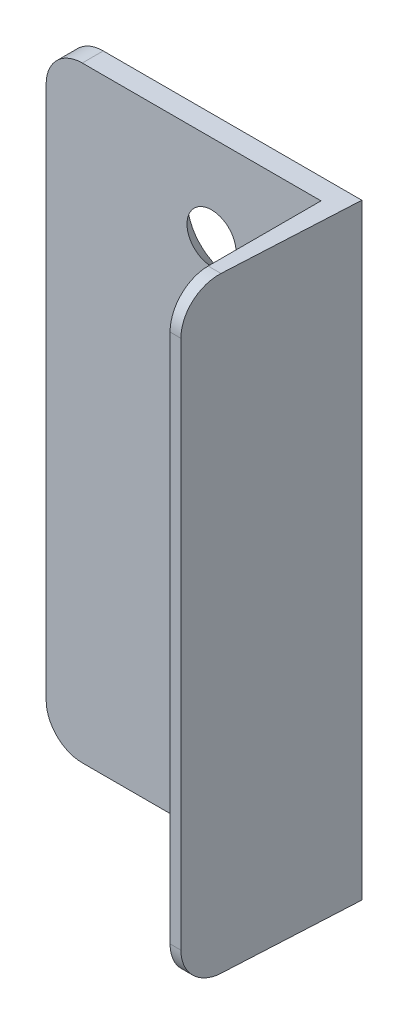
ISO-10303-21;
HEADER;
FILE_DESCRIPTION(('STEP AP214'),'2;1');
FILE_NAME('part.step','',(''),(''),'','','');
FILE_SCHEMA(('AUTOMOTIVE_DESIGN { 1 0 10303 214 1 1 1 1 }'));
ENDSEC;
DATA;
#1=APPLICATION_CONTEXT('core data for automotive mechanical design processes');
#2=APPLICATION_PROTOCOL_DEFINITION('international standard','automotive_design',2000,#1);
#3=PRODUCT_CONTEXT('',#1,'mechanical');
#4=PRODUCT('Part','Part','',(#3));
#5=PRODUCT_RELATED_PRODUCT_CATEGORY('part','',(#4));
#6=PRODUCT_DEFINITION_FORMATION('','',#4);
#7=PRODUCT_DEFINITION_CONTEXT('part definition',#1,'design');
#8=PRODUCT_DEFINITION('design','',#6,#7);
#9=PRODUCT_DEFINITION_SHAPE('','',#8);
#10=(LENGTH_UNIT() NAMED_UNIT(*) SI_UNIT(.MILLI.,.METRE.));
#11=(NAMED_UNIT(*) PLANE_ANGLE_UNIT() SI_UNIT($,.RADIAN.));
#12=(NAMED_UNIT(*) SI_UNIT($,.STERADIAN.) SOLID_ANGLE_UNIT());
#13=UNCERTAINTY_MEASURE_WITH_UNIT(LENGTH_MEASURE(1.E-05),#10,'distance_accuracy_value','');
#14=(GEOMETRIC_REPRESENTATION_CONTEXT(3) GLOBAL_UNCERTAINTY_ASSIGNED_CONTEXT((#13)) GLOBAL_UNIT_ASSIGNED_CONTEXT((#10,
#11,#12)) REPRESENTATION_CONTEXT('',''));
#15=CARTESIAN_POINT('',(0.,0.,0.));
#16=DIRECTION('',(0.,0.,1.));
#17=DIRECTION('',(1.,0.,0.));
#18=AXIS2_PLACEMENT_3D('',#15,#16,#17);
#19=CARTESIAN_POINT('',(-15.4,41.95,2.9));
#20=DIRECTION('',(0.,-1.,0.));
#21=DIRECTION('',(0.,0.,-1.));
#22=AXIS2_PLACEMENT_3D('',#19,#20,#21);
#23=PLANE('',#22);
#24=DIRECTION('',(-0.0523359562429439,0.,0.998629534754574));
#25=VECTOR('',#24,1.);
#26=CARTESIAN_POINT('',(20.4,41.95,0.));
#27=LINE('',#26,#25);
#28=CARTESIAN_POINT('',(20.4,41.95,0.));
#29=VERTEX_POINT('',#28);
#30=CARTESIAN_POINT('',(19.4290669564048,41.95,18.5265061194722));
#31=VERTEX_POINT('',#30);
#32=EDGE_CURVE('E123',#29,#31,#27,.T.);
#33=ORIENTED_EDGE('',*,*,#32,.F.);
#34=DIRECTION('',(-1.,0.,0.));
#35=VECTOR('',#34,1.);
#36=CARTESIAN_POINT('',(-15.4,41.95,0.));
#37=LINE('',#36,#35);
#38=CARTESIAN_POINT('',(-15.4,41.95,0.));
#39=VERTEX_POINT('',#38);
#40=EDGE_CURVE('E132',#29,#39,#37,.T.);
#41=ORIENTED_EDGE('',*,*,#40,.T.);
#42=DIRECTION('',(0.,0.,-1.));
#43=VECTOR('',#42,1.);
#44=CARTESIAN_POINT('',(-15.4,41.95,2.9));
#45=LINE('',#44,#43);
#46=CARTESIAN_POINT('',(-15.4,41.95,2.9));
#47=VERTEX_POINT('',#46);
#48=EDGE_CURVE('E177',#47,#39,#45,.T.);
#49=ORIENTED_EDGE('',*,*,#48,.F.);
#50=DIRECTION('',(-1.,0.,0.));
#51=VECTOR('',#50,1.);
#52=CARTESIAN_POINT('',(-15.4,41.95,2.9));
#53=LINE('',#52,#51);
#54=CARTESIAN_POINT('',(17.65,41.95,2.9));
#55=VERTEX_POINT('',#54);
#56=EDGE_CURVE('E163',#55,#47,#53,.T.);
#57=ORIENTED_EDGE('',*,*,#56,.F.);
#58=DIRECTION('',(0.,0.,-1.));
#59=VECTOR('',#58,1.);
#60=CARTESIAN_POINT('',(17.65,41.95,23.8));
#61=LINE('',#60,#59);
#62=CARTESIAN_POINT('',(17.65,41.95,18.5265061194722));
#63=VERTEX_POINT('',#62);
#64=EDGE_CURVE('E133',#63,#55,#61,.T.);
#65=ORIENTED_EDGE('',*,*,#64,.F.);
#66=DIRECTION('',(1.,0.,0.));
#67=VECTOR('',#66,1.);
#68=CARTESIAN_POINT('',(-7.35000000000001,41.95,18.5265061194722));
#69=LINE('',#68,#67);
#70=EDGE_CURVE('E140',#63,#31,#69,.T.);
#71=ORIENTED_EDGE('',*,*,#70,.T.);
#72=EDGE_LOOP('',(#33,#41,#49,#57,#65,#71));
#73=FACE_BOUND('',#72,.T.);
#74=ADVANCED_FACE('F45',(#73),#23,.F.);
#75=CARTESIAN_POINT('',(0.,0.,23.8));
#76=DIRECTION('',(0.,0.,-1.));
#77=DIRECTION('',(-1.,0.,0.));
#78=AXIS2_PLACEMENT_3D('',#75,#76,#77);
#79=PLANE('',#78);
#80=DIRECTION('',(0.,-1.,0.));
#81=VECTOR('',#80,1.);
#82=CARTESIAN_POINT('',(19.1526948530636,0.,23.8));
#83=LINE('',#82,#81);
#84=CARTESIAN_POINT('',(19.1526948530636,36.6765061194726,23.8));
#85=VERTEX_POINT('',#84);
#86=CARTESIAN_POINT('',(19.1526948530636,-36.6765061194722,23.8));
#87=VERTEX_POINT('',#86);
#88=EDGE_CURVE('E59',#85,#87,#83,.T.);
#89=ORIENTED_EDGE('',*,*,#88,.F.);
#90=DIRECTION('',(1.,0.,0.));
#91=VECTOR('',#90,1.);
#92=CARTESIAN_POINT('',(-7.35000000000001,36.6765061194722,23.8));
#93=LINE('',#92,#91);
#94=CARTESIAN_POINT('',(17.65,36.6765061194722,23.8));
#95=VERTEX_POINT('',#94);
#96=EDGE_CURVE('E66',#85,#95,#93,.F.);
#97=ORIENTED_EDGE('',*,*,#96,.T.);
#98=DIRECTION('',(0.,-1.,0.));
#99=VECTOR('',#98,1.);
#100=CARTESIAN_POINT('',(17.65,41.95,23.8));
#101=LINE('',#100,#99);
#102=CARTESIAN_POINT('',(17.65,-36.6765061194722,23.8));
#103=VERTEX_POINT('',#102);
#104=EDGE_CURVE('E195',#95,#103,#101,.T.);
#105=ORIENTED_EDGE('',*,*,#104,.T.);
#106=DIRECTION('',(1.,0.,0.));
#107=VECTOR('',#106,1.);
#108=CARTESIAN_POINT('',(-7.35000000000001,-36.6765061194722,23.8));
#109=LINE('',#108,#107);
#110=EDGE_CURVE('E53',#87,#103,#109,.F.);
#111=ORIENTED_EDGE('',*,*,#110,.F.);
#112=EDGE_LOOP('',(#89,#97,#105,#111));
#113=FACE_BOUND('',#112,.T.);
#114=ADVANCED_FACE('F202',(#113),#79,.F.);
#115=CARTESIAN_POINT('',(-15.4,-41.95,2.9));
#116=DIRECTION('',(0.,1.,0.));
#117=DIRECTION('',(0.,0.,1.));
#118=AXIS2_PLACEMENT_3D('',#115,#116,#117);
#119=PLANE('',#118);
#120=DIRECTION('',(0.0523359562429439,0.,-0.998629534754574));
#121=VECTOR('',#120,1.);
#122=CARTESIAN_POINT('',(20.4,-41.95,0.));
#123=LINE('',#122,#121);
#124=CARTESIAN_POINT('',(19.4290669564048,-41.95,18.5265061194722));
#125=VERTEX_POINT('',#124);
#126=CARTESIAN_POINT('',(20.4,-41.95,0.));
#127=VERTEX_POINT('',#126);
#128=EDGE_CURVE('E126',#125,#127,#123,.T.);
#129=ORIENTED_EDGE('',*,*,#128,.F.);
#130=DIRECTION('',(1.,0.,0.));
#131=VECTOR('',#130,1.);
#132=CARTESIAN_POINT('',(-7.35000000000001,-41.95,18.5265061194722));
#133=LINE('',#132,#131);
#134=CARTESIAN_POINT('',(17.65,-41.95,18.5265061194722));
#135=VERTEX_POINT('',#134);
#136=EDGE_CURVE('E246',#135,#125,#133,.T.);
#137=ORIENTED_EDGE('',*,*,#136,.F.);
#138=DIRECTION('',(0.,0.,-1.));
#139=VECTOR('',#138,1.);
#140=CARTESIAN_POINT('',(17.65,-41.95,23.8));
#141=LINE('',#140,#139);
#142=CARTESIAN_POINT('',(17.65,-41.95,2.9));
#143=VERTEX_POINT('',#142);
#144=EDGE_CURVE('E197',#135,#143,#141,.T.);
#145=ORIENTED_EDGE('',*,*,#144,.T.);
#146=DIRECTION('',(1.,0.,0.));
#147=VECTOR('',#146,1.);
#148=CARTESIAN_POINT('',(-15.4,-41.95,2.9));
#149=LINE('',#148,#147);
#150=CARTESIAN_POINT('',(-15.4,-41.95,2.9));
#151=VERTEX_POINT('',#150);
#152=EDGE_CURVE('E169',#151,#143,#149,.T.);
#153=ORIENTED_EDGE('',*,*,#152,.F.);
#154=DIRECTION('',(0.,0.,-1.));
#155=VECTOR('',#154,1.);
#156=CARTESIAN_POINT('',(-15.4,-41.95,2.9));
#157=LINE('',#156,#155);
#158=CARTESIAN_POINT('',(-15.4,-41.95,0.));
#159=VERTEX_POINT('',#158);
#160=EDGE_CURVE('E164',#151,#159,#157,.T.);
#161=ORIENTED_EDGE('',*,*,#160,.T.);
#162=DIRECTION('',(1.,0.,0.));
#163=VECTOR('',#162,1.);
#164=CARTESIAN_POINT('',(-15.4,-41.95,0.));
#165=LINE('',#164,#163);
#166=EDGE_CURVE('E160',#159,#127,#165,.T.);
#167=ORIENTED_EDGE('',*,*,#166,.T.);
#168=EDGE_LOOP('',(#129,#137,#145,#153,#161,#167));
#169=FACE_BOUND('',#168,.T.);
#170=ADVANCED_FACE('F245',(#169),#119,.F.);
#171=CARTESIAN_POINT('',(-7.35000000000001,36.6765061194722,18.5265061194722));
#172=DIRECTION('',(1.,0.,0.));
#173=DIRECTION('',(0.,0.,-1.));
#174=AXIS2_PLACEMENT_3D('',#171,#172,#173);
#175=CYLINDRICAL_SURFACE('',#174,5.27349388052784);
#176=CARTESIAN_POINT('',(19.4290669564048,36.6765061194722,18.5265061194722));
#177=DIRECTION('',(0.998629534754574,0.,0.0523359562429439));
#178=DIRECTION('',(0.052335956242944,0.,-0.998629534754574));
#179=AXIS2_PLACEMENT_3D('',#176,#177,#178);
#180=ELLIPSE('',#179,5.28073093874984,5.27349388052784);
#181=EDGE_CURVE('E269',#31,#85,#180,.T.);
#182=ORIENTED_EDGE('',*,*,#181,.F.);
#183=ORIENTED_EDGE('',*,*,#70,.F.);
#184=CARTESIAN_POINT('',(17.65,36.6765061194722,18.5265061194722));
#185=DIRECTION('',(1.,0.,0.));
#186=DIRECTION('',(0.,1.,0.));
#187=AXIS2_PLACEMENT_3D('',#184,#185,#186);
#188=CIRCLE('',#187,5.27349388052784);
#189=EDGE_CURVE('E200',#95,#63,#188,.F.);
#190=ORIENTED_EDGE('',*,*,#189,.F.);
#191=ORIENTED_EDGE('',*,*,#96,.F.);
#192=EDGE_LOOP('',(#182,#183,#190,#191));
#193=FACE_BOUND('',#192,.T.);
#194=ADVANCED_FACE('F274',(#193),#175,.T.);
#195=CARTESIAN_POINT('',(-7.35000000000001,-36.6765061194722,18.5265061194722));
#196=DIRECTION('',(1.,0.,0.));
#197=DIRECTION('',(0.,0.,-1.));
#198=AXIS2_PLACEMENT_3D('',#195,#196,#197);
#199=CYLINDRICAL_SURFACE('',#198,5.27349388052784);
#200=CARTESIAN_POINT('',(19.4290669564048,-36.6765061194722,18.5265061194722));
#201=DIRECTION('',(0.998629534754574,0.,0.0523359562429439));
#202=DIRECTION('',(0.052335956242944,0.,-0.998629534754574));
#203=AXIS2_PLACEMENT_3D('',#200,#201,#202);
#204=ELLIPSE('',#203,5.28073093874985,5.27349388052784);
#205=EDGE_CURVE('E11',#87,#125,#204,.T.);
#206=ORIENTED_EDGE('',*,*,#205,.F.);
#207=ORIENTED_EDGE('',*,*,#110,.T.);
#208=CARTESIAN_POINT('',(17.65,-36.6765061194722,18.5265061194722));
#209=DIRECTION('',(1.,0.,0.));
#210=DIRECTION('',(0.,1.,0.));
#211=AXIS2_PLACEMENT_3D('',#208,#209,#210);
#212=CIRCLE('',#211,5.27349388052784);
#213=EDGE_CURVE('E188',#135,#103,#212,.F.);
#214=ORIENTED_EDGE('',*,*,#213,.F.);
#215=ORIENTED_EDGE('',*,*,#136,.T.);
#216=EDGE_LOOP('',(#206,#207,#214,#215));
#217=FACE_BOUND('',#216,.T.);
#218=ADVANCED_FACE('F186',(#217),#199,.T.);
#219=CARTESIAN_POINT('',(-15.4,36.95,0.));
#220=DIRECTION('',(0.,0.,1.));
#221=DIRECTION('',(1.,0.,0.));
#222=AXIS2_PLACEMENT_3D('',#219,#220,#221);
#223=PLANE('',#222);
#224=DIRECTION('',(0.,1.,0.));
#225=VECTOR('',#224,1.);
#226=CARTESIAN_POINT('',(20.4,-41.95,0.));
#227=LINE('',#226,#225);
#228=EDGE_CURVE('E120',#127,#29,#227,.T.);
#229=ORIENTED_EDGE('',*,*,#228,.F.);
#230=ORIENTED_EDGE('',*,*,#166,.F.);
#231=CARTESIAN_POINT('',(-15.4,-36.95,0.));
#232=DIRECTION('',(0.,0.,1.));
#233=DIRECTION('',(1.,0.,0.));
#234=AXIS2_PLACEMENT_3D('',#231,#232,#233);
#235=CIRCLE('',#234,5.);
#236=CARTESIAN_POINT('',(-20.4,-36.95,0.));
#237=VERTEX_POINT('',#236);
#238=EDGE_CURVE('E157',#237,#159,#235,.T.);
#239=ORIENTED_EDGE('',*,*,#238,.F.);
#240=DIRECTION('',(0.,-1.,0.));
#241=VECTOR('',#240,1.);
#242=CARTESIAN_POINT('',(-20.4,-36.95,0.));
#243=LINE('',#242,#241);
#244=CARTESIAN_POINT('',(-20.4,36.95,0.));
#245=VERTEX_POINT('',#244);
#246=EDGE_CURVE('E151',#245,#237,#243,.T.);
#247=ORIENTED_EDGE('',*,*,#246,.F.);
#248=CARTESIAN_POINT('',(-15.4,36.95,0.));
#249=DIRECTION('',(0.,0.,1.));
#250=DIRECTION('',(1.,0.,0.));
#251=AXIS2_PLACEMENT_3D('',#248,#249,#250);
#252=CIRCLE('',#251,5.);
#253=EDGE_CURVE('E147',#39,#245,#252,.T.);
#254=ORIENTED_EDGE('',*,*,#253,.F.);
#255=ORIENTED_EDGE('',*,*,#40,.F.);
#256=EDGE_LOOP('',(#229,#230,#239,#247,#254,#255));
#257=FACE_BOUND('',#256,.T.);
#258=CARTESIAN_POINT('',(2.50000000000002,-29.8956518577535,0.));
#259=DIRECTION('',(0.,0.,-1.));
#260=DIRECTION('',(-1.,0.,0.));
#261=AXIS2_PLACEMENT_3D('',#258,#259,#260);
#262=CIRCLE('',#261,6.3);
#263=CARTESIAN_POINT('',(-3.79999999999998,-29.8956518577535,0.));
#264=VERTEX_POINT('',#263);
#265=EDGE_CURVE('E257',#264,#264,#262,.T.);
#266=ORIENTED_EDGE('',*,*,#265,.F.);
#267=EDGE_LOOP('',(#266));
#268=FACE_BOUND('',#267,.T.);
#269=CARTESIAN_POINT('',(2.50000000000002,29.8956518577535,0.));
#270=DIRECTION('',(0.,0.,-1.));
#271=DIRECTION('',(-1.,0.,0.));
#272=AXIS2_PLACEMENT_3D('',#269,#270,#271);
#273=CIRCLE('',#272,6.3);
#274=CARTESIAN_POINT('',(-3.79999999999998,29.8956518577535,0.));
#275=VERTEX_POINT('',#274);
#276=EDGE_CURVE('E265',#275,#275,#273,.T.);
#277=ORIENTED_EDGE('',*,*,#276,.F.);
#278=EDGE_LOOP('',(#277));
#279=FACE_BOUND('',#278,.T.);
#280=ADVANCED_FACE('F144',(#257,#268,#279),#223,.F.);
#281=CARTESIAN_POINT('',(-15.4,36.95,2.9));
#282=DIRECTION('',(0.,0.,-1.));
#283=DIRECTION('',(-1.,0.,0.));
#284=AXIS2_PLACEMENT_3D('',#281,#282,#283);
#285=CYLINDRICAL_SURFACE('',#284,5.);
#286=ORIENTED_EDGE('',*,*,#253,.T.);
#287=DIRECTION('',(0.,0.,-1.));
#288=VECTOR('',#287,1.);
#289=CARTESIAN_POINT('',(-20.4,36.95,2.9));
#290=LINE('',#289,#288);
#291=CARTESIAN_POINT('',(-20.4,36.95,2.9));
#292=VERTEX_POINT('',#291);
#293=EDGE_CURVE('E173',#292,#245,#290,.T.);
#294=ORIENTED_EDGE('',*,*,#293,.F.);
#295=CARTESIAN_POINT('',(-15.4,36.95,2.9));
#296=DIRECTION('',(0.,0.,1.));
#297=DIRECTION('',(1.,0.,0.));
#298=AXIS2_PLACEMENT_3D('',#295,#296,#297);
#299=CIRCLE('',#298,5.);
#300=EDGE_CURVE('E215',#47,#292,#299,.T.);
#301=ORIENTED_EDGE('',*,*,#300,.F.);
#302=ORIENTED_EDGE('',*,*,#48,.T.);
#303=EDGE_LOOP('',(#286,#294,#301,#302));
#304=FACE_BOUND('',#303,.T.);
#305=ADVANCED_FACE('F239',(#304),#285,.T.);
#306=CARTESIAN_POINT('',(-20.4,-36.95,2.9));
#307=DIRECTION('',(1.,0.,0.));
#308=DIRECTION('',(0.,0.,-1.));
#309=AXIS2_PLACEMENT_3D('',#306,#307,#308);
#310=PLANE('',#309);
#311=ORIENTED_EDGE('',*,*,#246,.T.);
#312=DIRECTION('',(0.,0.,-1.));
#313=VECTOR('',#312,1.);
#314=CARTESIAN_POINT('',(-20.4,-36.95,2.9));
#315=LINE('',#314,#313);
#316=CARTESIAN_POINT('',(-20.4,-36.95,2.9));
#317=VERTEX_POINT('',#316);
#318=EDGE_CURVE('E168',#317,#237,#315,.T.);
#319=ORIENTED_EDGE('',*,*,#318,.F.);
#320=DIRECTION('',(0.,-1.,0.));
#321=VECTOR('',#320,1.);
#322=CARTESIAN_POINT('',(-20.4,-36.95,2.9));
#323=LINE('',#322,#321);
#324=EDGE_CURVE('E218',#292,#317,#323,.T.);
#325=ORIENTED_EDGE('',*,*,#324,.F.);
#326=ORIENTED_EDGE('',*,*,#293,.T.);
#327=EDGE_LOOP('',(#311,#319,#325,#326));
#328=FACE_BOUND('',#327,.T.);
#329=ADVANCED_FACE('F241',(#328),#310,.F.);
#330=CARTESIAN_POINT('',(-15.4,-36.95,2.9));
#331=DIRECTION('',(0.,0.,-1.));
#332=DIRECTION('',(-1.,0.,0.));
#333=AXIS2_PLACEMENT_3D('',#330,#331,#332);
#334=CYLINDRICAL_SURFACE('',#333,5.);
#335=ORIENTED_EDGE('',*,*,#238,.T.);
#336=ORIENTED_EDGE('',*,*,#160,.F.);
#337=CARTESIAN_POINT('',(-15.4,-36.95,2.9));
#338=DIRECTION('',(0.,0.,1.));
#339=DIRECTION('',(1.,0.,0.));
#340=AXIS2_PLACEMENT_3D('',#337,#338,#339);
#341=CIRCLE('',#340,5.);
#342=EDGE_CURVE('E221',#317,#151,#341,.T.);
#343=ORIENTED_EDGE('',*,*,#342,.F.);
#344=ORIENTED_EDGE('',*,*,#318,.T.);
#345=EDGE_LOOP('',(#335,#336,#343,#344));
#346=FACE_BOUND('',#345,.T.);
#347=ADVANCED_FACE('F244',(#346),#334,.T.);
#348=CARTESIAN_POINT('',(-15.4,36.95,2.9));
#349=DIRECTION('',(0.,0.,1.));
#350=DIRECTION('',(1.,0.,0.));
#351=AXIS2_PLACEMENT_3D('',#348,#349,#350);
#352=PLANE('',#351);
#353=CARTESIAN_POINT('',(2.50000000000002,29.8956518577535,2.9));
#354=DIRECTION('',(0.,0.,1.));
#355=DIRECTION('',(1.,0.,0.));
#356=AXIS2_PLACEMENT_3D('',#353,#354,#355);
#357=CIRCLE('',#356,3.4);
#358=CARTESIAN_POINT('',(5.90000000000001,29.8956518577535,2.9));
#359=VERTEX_POINT('',#358);
#360=EDGE_CURVE('E261',#359,#359,#357,.T.);
#361=ORIENTED_EDGE('',*,*,#360,.F.);
#362=EDGE_LOOP('',(#361));
#363=FACE_BOUND('',#362,.T.);
#364=CARTESIAN_POINT('',(2.50000000000002,-29.8956518577535,2.9));
#365=DIRECTION('',(0.,0.,1.));
#366=DIRECTION('',(1.,0.,0.));
#367=AXIS2_PLACEMENT_3D('',#364,#365,#366);
#368=CIRCLE('',#367,3.4);
#369=CARTESIAN_POINT('',(5.90000000000001,-29.8956518577535,2.9));
#370=VERTEX_POINT('',#369);
#371=EDGE_CURVE('E252',#370,#370,#368,.T.);
#372=ORIENTED_EDGE('',*,*,#371,.F.);
#373=EDGE_LOOP('',(#372));
#374=FACE_BOUND('',#373,.T.);
#375=DIRECTION('',(0.,-1.,0.));
#376=VECTOR('',#375,1.);
#377=CARTESIAN_POINT('',(17.65,41.95,2.9));
#378=LINE('',#377,#376);
#379=EDGE_CURVE('E199',#55,#143,#378,.T.);
#380=ORIENTED_EDGE('',*,*,#379,.F.);
#381=ORIENTED_EDGE('',*,*,#56,.T.);
#382=ORIENTED_EDGE('',*,*,#300,.T.);
#383=ORIENTED_EDGE('',*,*,#324,.T.);
#384=ORIENTED_EDGE('',*,*,#342,.T.);
#385=ORIENTED_EDGE('',*,*,#152,.T.);
#386=EDGE_LOOP('',(#380,#381,#382,#383,#384,#385));
#387=FACE_BOUND('',#386,.T.);
#388=ADVANCED_FACE('F229',(#363,#374,#387),#352,.T.);
#389=CARTESIAN_POINT('',(17.65,41.95,23.8));
#390=DIRECTION('',(1.,0.,0.));
#391=DIRECTION('',(0.,1.,0.));
#392=AXIS2_PLACEMENT_3D('',#389,#390,#391);
#393=PLANE('',#392);
#394=ORIENTED_EDGE('',*,*,#144,.F.);
#395=ORIENTED_EDGE('',*,*,#213,.T.);
#396=ORIENTED_EDGE('',*,*,#104,.F.);
#397=ORIENTED_EDGE('',*,*,#189,.T.);
#398=ORIENTED_EDGE('',*,*,#64,.T.);
#399=ORIENTED_EDGE('',*,*,#379,.T.);
#400=EDGE_LOOP('',(#394,#395,#396,#397,#398,#399));
#401=FACE_BOUND('',#400,.T.);
#402=ADVANCED_FACE('F193',(#401),#393,.F.);
#403=CARTESIAN_POINT('',(2.50000000000002,-29.8956518577535,0.));
#404=DIRECTION('',(0.,0.,-1.));
#405=DIRECTION('',(-1.,0.,0.));
#406=AXIS2_PLACEMENT_3D('',#403,#404,#405);
#407=CONICAL_SURFACE('',#406,6.3,0.785398163397449);
#408=ORIENTED_EDGE('',*,*,#265,.T.);
#409=EDGE_LOOP('',(#408));
#410=FACE_BOUND('',#409,.T.);
#411=ORIENTED_EDGE('',*,*,#371,.T.);
#412=EDGE_LOOP('',(#411));
#413=FACE_BOUND('',#412,.T.);
#414=ADVANCED_FACE('F290',(#410,#413),#407,.F.);
#415=CARTESIAN_POINT('',(2.50000000000002,29.8956518577535,0.));
#416=DIRECTION('',(0.,0.,-1.));
#417=DIRECTION('',(-1.,0.,0.));
#418=AXIS2_PLACEMENT_3D('',#415,#416,#417);
#419=CONICAL_SURFACE('',#418,6.3,0.785398163397449);
#420=ORIENTED_EDGE('',*,*,#276,.T.);
#421=EDGE_LOOP('',(#420));
#422=FACE_BOUND('',#421,.T.);
#423=ORIENTED_EDGE('',*,*,#360,.T.);
#424=EDGE_LOOP('',(#423));
#425=FACE_BOUND('',#424,.T.);
#426=ADVANCED_FACE('F319',(#422,#425),#419,.F.);
#427=CARTESIAN_POINT('',(20.4,0.,0.));
#428=DIRECTION('',(0.998629534754574,0.,0.0523359562429439));
#429=DIRECTION('',(0.0523359562429439,0.,-0.998629534754574));
#430=AXIS2_PLACEMENT_3D('',#427,#428,#429);
#431=PLANE('',#430);
#432=ORIENTED_EDGE('',*,*,#181,.T.);
#433=ORIENTED_EDGE('',*,*,#88,.T.);
#434=ORIENTED_EDGE('',*,*,#205,.T.);
#435=ORIENTED_EDGE('',*,*,#128,.T.);
#436=ORIENTED_EDGE('',*,*,#228,.T.);
#437=ORIENTED_EDGE('',*,*,#32,.T.);
#438=EDGE_LOOP('',(#432,#433,#434,#435,#436,#437));
#439=FACE_BOUND('',#438,.T.);
#440=ADVANCED_FACE('F122',(#439),#431,.T.);
#441=CLOSED_SHELL('',(#74,#114,#170,#194,#218,#280,#305,#329,#347,#388,#402,#414,#426,#440));
#442=MANIFOLD_SOLID_BREP('B2',#441);
#443=ADVANCED_BREP_SHAPE_REPRESENTATION('',(#18,#442),#14);
#444=SHAPE_DEFINITION_REPRESENTATION(#9,#443);
ENDSEC;
END-ISO-10303-21;
